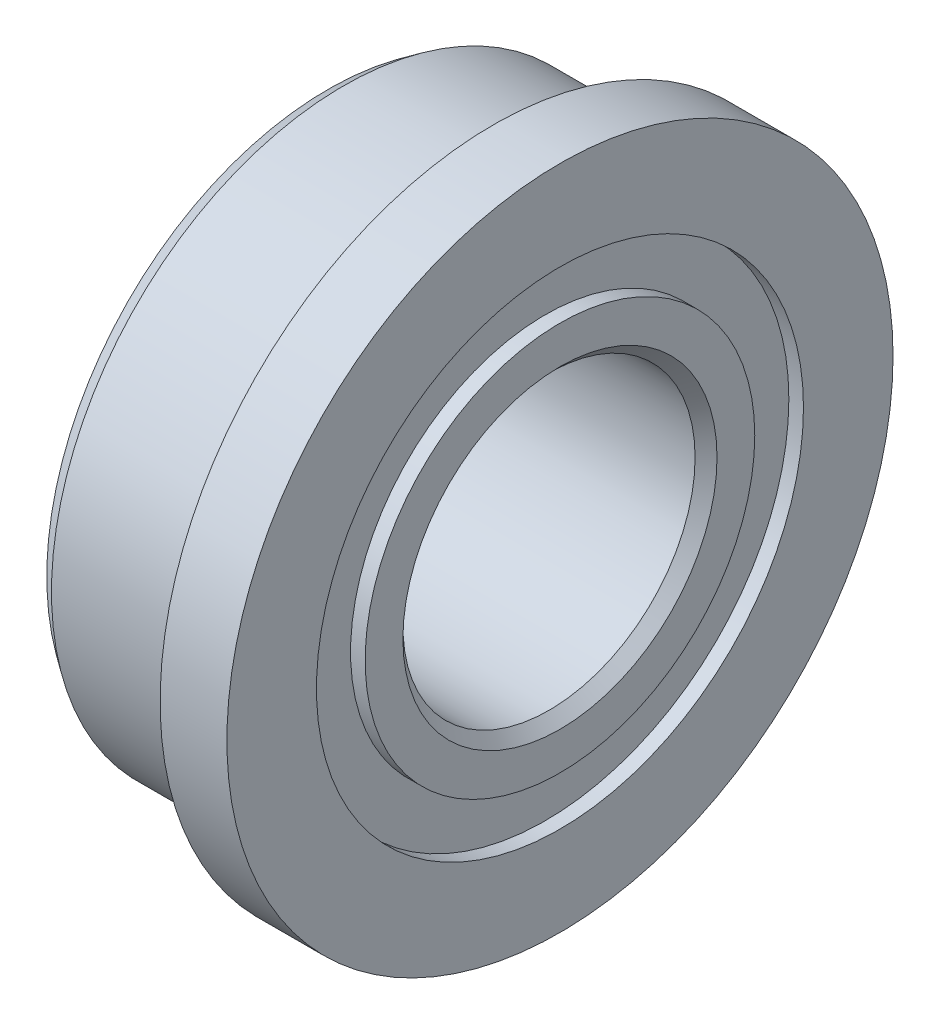
ISO-10303-21;
HEADER;
FILE_DESCRIPTION(('STEP AP214'),'2;1');
FILE_NAME('part.step','',(''),(''),'','','');
FILE_SCHEMA(('AUTOMOTIVE_DESIGN { 1 0 10303 214 1 1 1 1 }'));
ENDSEC;
DATA;
#1=APPLICATION_CONTEXT('core data for automotive mechanical design processes');
#2=APPLICATION_PROTOCOL_DEFINITION('international standard','automotive_design',2000,#1);
#3=PRODUCT_CONTEXT('',#1,'mechanical');
#4=PRODUCT('Part','Part','',(#3));
#5=PRODUCT_RELATED_PRODUCT_CATEGORY('part','',(#4));
#6=PRODUCT_DEFINITION_FORMATION('','',#4);
#7=PRODUCT_DEFINITION_CONTEXT('part definition',#1,'design');
#8=PRODUCT_DEFINITION('design','',#6,#7);
#9=PRODUCT_DEFINITION_SHAPE('','',#8);
#10=(LENGTH_UNIT() NAMED_UNIT(*) SI_UNIT(.MILLI.,.METRE.));
#11=(NAMED_UNIT(*) PLANE_ANGLE_UNIT() SI_UNIT($,.RADIAN.));
#12=(NAMED_UNIT(*) SI_UNIT($,.STERADIAN.) SOLID_ANGLE_UNIT());
#13=UNCERTAINTY_MEASURE_WITH_UNIT(LENGTH_MEASURE(1.E-05),#10,'distance_accuracy_value','');
#14=(GEOMETRIC_REPRESENTATION_CONTEXT(3) GLOBAL_UNCERTAINTY_ASSIGNED_CONTEXT((#13)) GLOBAL_UNIT_ASSIGNED_CONTEXT((#10,
#11,#12)) REPRESENTATION_CONTEXT('',''));
#15=CARTESIAN_POINT('',(0.,0.,0.));
#16=DIRECTION('',(0.,0.,1.));
#17=DIRECTION('',(1.,0.,0.));
#18=AXIS2_PLACEMENT_3D('',#15,#16,#17);
#19=CARTESIAN_POINT('',(-4.0000000000191,-1.89186773885686E-11,0.));
#20=DIRECTION('',(1.,0.,0.));
#21=DIRECTION('',(0.,0.,-1.));
#22=AXIS2_PLACEMENT_3D('',#19,#20,#21);
#23=CYLINDRICAL_SURFACE('',#22,3.33333333333333);
#24=CARTESIAN_POINT('',(-2.91107312729798,-1.89186773885686E-11,0.));
#25=DIRECTION('',(1.,0.,0.));
#26=DIRECTION('',(0.,0.,-1.));
#27=AXIS2_PLACEMENT_3D('',#24,#25,#26);
#28=CIRCLE('',#27,3.33333333333333);
#29=CARTESIAN_POINT('',(-2.91107312729798,-1.89186773885686E-11,-3.33333333333333));
#30=VERTEX_POINT('',#29);
#31=EDGE_CURVE('E96',#30,#30,#28,.T.);
#32=ORIENTED_EDGE('',*,*,#31,.T.);
#33=EDGE_LOOP('',(#32));
#34=FACE_BOUND('',#33,.T.);
#35=CARTESIAN_POINT('',(-3.17507312736301,-1.89186773885686E-11,0.));
#36=DIRECTION('',(1.,0.,0.));
#37=DIRECTION('',(0.,0.,-1.));
#38=AXIS2_PLACEMENT_3D('',#35,#36,#37);
#39=CIRCLE('',#38,3.33333333333333);
#40=CARTESIAN_POINT('',(-3.17507312736301,-1.89186773885686E-11,-3.33333333333333));
#41=VERTEX_POINT('',#40);
#42=EDGE_CURVE('E10',#41,#41,#39,.T.);
#43=ORIENTED_EDGE('',*,*,#42,.F.);
#44=EDGE_LOOP('',(#43));
#45=FACE_BOUND('',#44,.T.);
#46=ADVANCED_FACE('F37',(#34,#45),#23,.F.);
#47=CARTESIAN_POINT('',(-3.17507312736301,3.85010438242014,0.));
#48=DIRECTION('',(-1.,0.,0.));
#49=DIRECTION('',(0.,0.,1.));
#50=AXIS2_PLACEMENT_3D('',#47,#48,#49);
#51=PLANE('',#50);
#52=ORIENTED_EDGE('',*,*,#42,.T.);
#53=EDGE_LOOP('',(#52));
#54=FACE_BOUND('',#53,.T.);
#55=CARTESIAN_POINT('',(-3.17507312736301,-1.89186773885686E-11,0.));
#56=DIRECTION('',(1.,0.,0.));
#57=DIRECTION('',(0.,0.,-1.));
#58=AXIS2_PLACEMENT_3D('',#55,#56,#57);
#59=CIRCLE('',#58,3.85010438243906);
#60=CARTESIAN_POINT('',(-3.17507312736301,-1.89186773885686E-11,-3.85010438243906));
#61=VERTEX_POINT('',#60);
#62=EDGE_CURVE('E43',#61,#61,#59,.T.);
#63=ORIENTED_EDGE('',*,*,#62,.F.);
#64=EDGE_LOOP('',(#63));
#65=FACE_BOUND('',#64,.T.);
#66=ADVANCED_FACE('F114',(#54,#65),#51,.T.);
#67=CARTESIAN_POINT('',(-2.96099999992397,-1.89186773885686E-11,0.));
#68=DIRECTION('',(1.,0.,0.));
#69=DIRECTION('',(0.,0.,-1.));
#70=AXIS2_PLACEMENT_3D('',#67,#68,#69);
#71=CONICAL_SURFACE('',#70,4.,0.610865238198014);
#72=ORIENTED_EDGE('',*,*,#62,.T.);
#73=EDGE_LOOP('',(#72));
#74=FACE_BOUND('',#73,.T.);
#75=CARTESIAN_POINT('',(-2.96099999992397,-1.89186773885686E-11,0.));
#76=DIRECTION('',(1.,0.,0.));
#77=DIRECTION('',(0.,0.,-1.));
#78=AXIS2_PLACEMENT_3D('',#75,#76,#77);
#79=CIRCLE('',#78,4.);
#80=CARTESIAN_POINT('',(-2.96099999992397,-1.89186773885686E-11,-4.));
#81=VERTEX_POINT('',#80);
#82=EDGE_CURVE('E47',#81,#81,#79,.T.);
#83=ORIENTED_EDGE('',*,*,#82,.F.);
#84=EDGE_LOOP('',(#83));
#85=FACE_BOUND('',#84,.T.);
#86=ADVANCED_FACE('F118',(#74,#85),#71,.T.);
#87=CARTESIAN_POINT('',(-4.0000000000191,-1.89186773885686E-11,0.));
#88=DIRECTION('',(1.,0.,0.));
#89=DIRECTION('',(0.,0.,-1.));
#90=AXIS2_PLACEMENT_3D('',#87,#88,#89);
#91=CYLINDRICAL_SURFACE('',#90,4.);
#92=ORIENTED_EDGE('',*,*,#82,.T.);
#93=EDGE_LOOP('',(#92));
#94=FACE_BOUND('',#93,.T.);
#95=CARTESIAN_POINT('',(-0.934073127363007,-1.89186773885686E-11,0.));
#96=DIRECTION('',(1.,0.,0.));
#97=DIRECTION('',(0.,0.,-1.));
#98=AXIS2_PLACEMENT_3D('',#95,#96,#97);
#99=CIRCLE('',#98,4.);
#100=CARTESIAN_POINT('',(-0.934073127363007,-1.89186773885686E-11,-4.));
#101=VERTEX_POINT('',#100);
#102=EDGE_CURVE('E51',#101,#101,#99,.T.);
#103=ORIENTED_EDGE('',*,*,#102,.F.);
#104=EDGE_LOOP('',(#103));
#105=FACE_BOUND('',#104,.T.);
#106=ADVANCED_FACE('F122',(#94,#105),#91,.T.);
#107=CARTESIAN_POINT('',(-0.914073127363007,-1.89188942290031E-11,0.));
#108=DIRECTION('',(1.,0.,0.));
#109=DIRECTION('',(0.,0.,-1.));
#110=AXIS2_PLACEMENT_3D('',#107,#108,#109);
#111=TOROIDAL_SURFACE('',#110,4.,0.0200000000000001);
#112=ORIENTED_EDGE('',*,*,#102,.T.);
#113=EDGE_LOOP('',(#112));
#114=FACE_BOUND('',#113,.T.);
#115=CARTESIAN_POINT('',(-0.914073127363007,-1.89186773885686E-11,0.));
#116=DIRECTION('',(1.,0.,0.));
#117=DIRECTION('',(0.,0.,-1.));
#118=AXIS2_PLACEMENT_3D('',#115,#116,#117);
#119=CIRCLE('',#118,4.02);
#120=CARTESIAN_POINT('',(-0.914073127363007,-1.89186773885686E-11,-4.02));
#121=VERTEX_POINT('',#120);
#122=EDGE_CURVE('E56',#121,#121,#119,.T.);
#123=ORIENTED_EDGE('',*,*,#122,.F.);
#124=EDGE_LOOP('',(#123));
#125=FACE_BOUND('',#124,.T.);
#126=ADVANCED_FACE('F128',(#114,#125),#111,.F.);
#127=CARTESIAN_POINT('',(-0.914073127363007,4.55949999998108,0.));
#128=DIRECTION('',(-1.,0.,0.));
#129=DIRECTION('',(0.,0.,1.));
#130=AXIS2_PLACEMENT_3D('',#127,#128,#129);
#131=PLANE('',#130);
#132=ORIENTED_EDGE('',*,*,#122,.T.);
#133=EDGE_LOOP('',(#132));
#134=FACE_BOUND('',#133,.T.);
#135=CARTESIAN_POINT('',(-0.914073127363007,-1.89186773885686E-11,0.));
#136=DIRECTION('',(1.,0.,0.));
#137=DIRECTION('',(0.,0.,-1.));
#138=AXIS2_PLACEMENT_3D('',#135,#136,#137);
#139=CIRCLE('',#138,4.5595);
#140=CARTESIAN_POINT('',(-0.914073127363007,-1.89186773885686E-11,-4.5595));
#141=VERTEX_POINT('',#140);
#142=EDGE_CURVE('E59',#141,#141,#139,.T.);
#143=ORIENTED_EDGE('',*,*,#142,.F.);
#144=EDGE_LOOP('',(#143));
#145=FACE_BOUND('',#144,.T.);
#146=ADVANCED_FACE('F132',(#134,#145),#131,.T.);
#147=CARTESIAN_POINT('',(-4.0000000000191,-1.89186773885686E-11,0.));
#148=DIRECTION('',(1.,0.,0.));
#149=DIRECTION('',(0.,0.,-1.));
#150=AXIS2_PLACEMENT_3D('',#147,#148,#149);
#151=CYLINDRICAL_SURFACE('',#150,4.5595);
#152=ORIENTED_EDGE('',*,*,#142,.T.);
#153=EDGE_LOOP('',(#152));
#154=FACE_BOUND('',#153,.T.);
#155=CARTESIAN_POINT('',(-7.31273630070334E-05,-1.89186773885686E-11,0.));
#156=DIRECTION('',(1.,0.,0.));
#157=DIRECTION('',(0.,0.,-1.));
#158=AXIS2_PLACEMENT_3D('',#155,#156,#157);
#159=CIRCLE('',#158,4.5595);
#160=CARTESIAN_POINT('',(-7.31273630070334E-05,-1.89186773885686E-11,-4.5595));
#161=VERTEX_POINT('',#160);
#162=EDGE_CURVE('E62',#161,#161,#159,.T.);
#163=ORIENTED_EDGE('',*,*,#162,.F.);
#164=EDGE_LOOP('',(#163));
#165=FACE_BOUND('',#164,.T.);
#166=ADVANCED_FACE('F136',(#154,#165),#151,.T.);
#167=CARTESIAN_POINT('',(-7.31273630073948E-05,3.33333333331441,0.));
#168=DIRECTION('',(1.,0.,0.));
#169=DIRECTION('',(0.,0.,-1.));
#170=AXIS2_PLACEMENT_3D('',#167,#168,#169);
#171=PLANE('',#170);
#172=ORIENTED_EDGE('',*,*,#162,.T.);
#173=EDGE_LOOP('',(#172));
#174=FACE_BOUND('',#173,.T.);
#175=CARTESIAN_POINT('',(-7.31273630070334E-05,-1.89186773885686E-11,0.));
#176=DIRECTION('',(1.,0.,0.));
#177=DIRECTION('',(0.,0.,-1.));
#178=AXIS2_PLACEMENT_3D('',#175,#176,#177);
#179=CIRCLE('',#178,3.33333333333333);
#180=CARTESIAN_POINT('',(-7.31273630070334E-05,-1.89186773885686E-11,-3.33333333333333));
#181=VERTEX_POINT('',#180);
#182=EDGE_CURVE('E66',#181,#181,#179,.T.);
#183=ORIENTED_EDGE('',*,*,#182,.F.);
#184=EDGE_LOOP('',(#183));
#185=FACE_BOUND('',#184,.T.);
#186=ADVANCED_FACE('F140',(#174,#185),#171,.T.);
#187=CARTESIAN_POINT('',(-4.0000000000191,-1.89186773885686E-11,0.));
#188=DIRECTION('',(1.,0.,0.));
#189=DIRECTION('',(0.,0.,-1.));
#190=AXIS2_PLACEMENT_3D('',#187,#188,#189);
#191=CYLINDRICAL_SURFACE('',#190,3.33333333333333);
#192=ORIENTED_EDGE('',*,*,#182,.T.);
#193=EDGE_LOOP('',(#192));
#194=FACE_BOUND('',#193,.T.);
#195=CARTESIAN_POINT('',(-0.2,-1.89186773885686E-11,0.));
#196=DIRECTION('',(1.,0.,0.));
#197=DIRECTION('',(0.,0.,-1.));
#198=AXIS2_PLACEMENT_3D('',#195,#196,#197);
#199=CIRCLE('',#198,3.33333333333333);
#200=CARTESIAN_POINT('',(-0.2,-1.89186773885686E-11,-3.33333333333333));
#201=VERTEX_POINT('',#200);
#202=EDGE_CURVE('E69',#201,#201,#199,.T.);
#203=ORIENTED_EDGE('',*,*,#202,.F.);
#204=EDGE_LOOP('',(#203));
#205=FACE_BOUND('',#204,.T.);
#206=ADVANCED_FACE('F144',(#194,#205),#191,.F.);
#207=CARTESIAN_POINT('',(-0.2,2.66666666664775,0.));
#208=DIRECTION('',(1.,0.,0.));
#209=DIRECTION('',(0.,0.,-1.));
#210=AXIS2_PLACEMENT_3D('',#207,#208,#209);
#211=PLANE('',#210);
#212=ORIENTED_EDGE('',*,*,#202,.T.);
#213=EDGE_LOOP('',(#212));
#214=FACE_BOUND('',#213,.T.);
#215=CARTESIAN_POINT('',(-0.2,-1.89186773885686E-11,0.));
#216=DIRECTION('',(1.,0.,0.));
#217=DIRECTION('',(0.,0.,-1.));
#218=AXIS2_PLACEMENT_3D('',#215,#216,#217);
#219=CIRCLE('',#218,2.66666666666667);
#220=CARTESIAN_POINT('',(-0.2,-1.89186773885686E-11,-2.66666666666667));
#221=VERTEX_POINT('',#220);
#222=EDGE_CURVE('E72',#221,#221,#219,.T.);
#223=ORIENTED_EDGE('',*,*,#222,.F.);
#224=EDGE_LOOP('',(#223));
#225=FACE_BOUND('',#224,.T.);
#226=ADVANCED_FACE('F148',(#214,#225),#211,.T.);
#227=CARTESIAN_POINT('',(-4.0000000000191,-1.89186773885686E-11,0.));
#228=DIRECTION('',(1.,0.,0.));
#229=DIRECTION('',(0.,0.,-1.));
#230=AXIS2_PLACEMENT_3D('',#227,#228,#229);
#231=CYLINDRICAL_SURFACE('',#230,2.66666666666667);
#232=ORIENTED_EDGE('',*,*,#222,.T.);
#233=EDGE_LOOP('',(#232));
#234=FACE_BOUND('',#233,.T.);
#235=CARTESIAN_POINT('',(-7.31273630070334E-05,-1.89186773885686E-11,0.));
#236=DIRECTION('',(1.,0.,0.));
#237=DIRECTION('',(0.,0.,-1.));
#238=AXIS2_PLACEMENT_3D('',#235,#236,#237);
#239=CIRCLE('',#238,2.66666666666667);
#240=CARTESIAN_POINT('',(-7.31273630070334E-05,-1.89186773885686E-11,-2.66666666666667));
#241=VERTEX_POINT('',#240);
#242=EDGE_CURVE('E75',#241,#241,#239,.T.);
#243=ORIENTED_EDGE('',*,*,#242,.F.);
#244=EDGE_LOOP('',(#243));
#245=FACE_BOUND('',#244,.T.);
#246=ADVANCED_FACE('F152',(#234,#245),#231,.T.);
#247=CARTESIAN_POINT('',(-7.31273630073834E-05,2.15010438245956,0.));
#248=DIRECTION('',(1.,0.,0.));
#249=DIRECTION('',(0.,0.,-1.));
#250=AXIS2_PLACEMENT_3D('',#247,#248,#249);
#251=PLANE('',#250);
#252=ORIENTED_EDGE('',*,*,#242,.T.);
#253=EDGE_LOOP('',(#252));
#254=FACE_BOUND('',#253,.T.);
#255=CARTESIAN_POINT('',(-7.31273630070334E-05,-1.89186773885686E-11,0.));
#256=DIRECTION('',(1.,0.,0.));
#257=DIRECTION('',(0.,0.,-1.));
#258=AXIS2_PLACEMENT_3D('',#255,#256,#257);
#259=CIRCLE('',#258,2.15010438247848);
#260=CARTESIAN_POINT('',(-7.31273630070334E-05,-1.89186773885686E-11,-2.15010438247848));
#261=VERTEX_POINT('',#260);
#262=EDGE_CURVE('E78',#261,#261,#259,.T.);
#263=ORIENTED_EDGE('',*,*,#262,.F.);
#264=EDGE_LOOP('',(#263));
#265=FACE_BOUND('',#264,.T.);
#266=ADVANCED_FACE('F156',(#254,#265),#251,.T.);
#267=CARTESIAN_POINT('',(-0.149968672244967,-1.89186773885686E-11,0.));
#268=DIRECTION('',(1.,0.,0.));
#269=DIRECTION('',(0.,0.,-1.));
#270=AXIS2_PLACEMENT_3D('',#267,#268,#269);
#271=CONICAL_SURFACE('',#270,2.,0.786094288775304);
#272=ORIENTED_EDGE('',*,*,#262,.T.);
#273=EDGE_LOOP('',(#272));
#274=FACE_BOUND('',#273,.T.);
#275=CARTESIAN_POINT('',(-0.149968672244967,-1.89186773885686E-11,0.));
#276=DIRECTION('',(1.,0.,0.));
#277=DIRECTION('',(0.,0.,-1.));
#278=AXIS2_PLACEMENT_3D('',#275,#276,#277);
#279=CIRCLE('',#278,2.);
#280=CARTESIAN_POINT('',(-0.149968672244967,-1.89186773885686E-11,-2.));
#281=VERTEX_POINT('',#280);
#282=EDGE_CURVE('E81',#281,#281,#279,.T.);
#283=ORIENTED_EDGE('',*,*,#282,.F.);
#284=EDGE_LOOP('',(#283));
#285=FACE_BOUND('',#284,.T.);
#286=ADVANCED_FACE('F160',(#274,#285),#271,.F.);
#287=CARTESIAN_POINT('',(-4.0000000000191,-1.89186773885686E-11,0.));
#288=DIRECTION('',(1.,0.,0.));
#289=DIRECTION('',(0.,0.,-1.));
#290=AXIS2_PLACEMENT_3D('',#287,#288,#289);
#291=CYLINDRICAL_SURFACE('',#290,2.);
#292=ORIENTED_EDGE('',*,*,#282,.T.);
#293=EDGE_LOOP('',(#292));
#294=FACE_BOUND('',#293,.T.);
#295=CARTESIAN_POINT('',(-2.96114633056183,-1.89186773885686E-11,0.));
#296=DIRECTION('',(1.,0.,0.));
#297=DIRECTION('',(0.,0.,-1.));
#298=AXIS2_PLACEMENT_3D('',#295,#296,#297);
#299=CIRCLE('',#298,2.);
#300=CARTESIAN_POINT('',(-2.96114633056183,-1.89186773885686E-11,-2.));
#301=VERTEX_POINT('',#300);
#302=EDGE_CURVE('E84',#301,#301,#299,.T.);
#303=ORIENTED_EDGE('',*,*,#302,.F.);
#304=EDGE_LOOP('',(#303));
#305=FACE_BOUND('',#304,.T.);
#306=ADVANCED_FACE('F164',(#294,#305),#291,.F.);
#307=CARTESIAN_POINT('',(-3.17507312736301,-1.89186773885686E-11,0.));
#308=DIRECTION('',(-1.,0.,0.));
#309=DIRECTION('',(0.,0.,1.));
#310=AXIS2_PLACEMENT_3D('',#307,#308,#309);
#311=CONICAL_SURFACE('',#310,2.15010438247848,0.611840775427929);
#312=ORIENTED_EDGE('',*,*,#302,.T.);
#313=EDGE_LOOP('',(#312));
#314=FACE_BOUND('',#313,.T.);
#315=CARTESIAN_POINT('',(-3.17507312736301,-1.89186773885686E-11,0.));
#316=DIRECTION('',(1.,0.,0.));
#317=DIRECTION('',(0.,0.,-1.));
#318=AXIS2_PLACEMENT_3D('',#315,#316,#317);
#319=CIRCLE('',#318,2.15010438247848);
#320=CARTESIAN_POINT('',(-3.17507312736301,-1.89186773885686E-11,-2.15010438247848));
#321=VERTEX_POINT('',#320);
#322=EDGE_CURVE('E87',#321,#321,#319,.T.);
#323=ORIENTED_EDGE('',*,*,#322,.F.);
#324=EDGE_LOOP('',(#323));
#325=FACE_BOUND('',#324,.T.);
#326=ADVANCED_FACE('F168',(#314,#325),#311,.F.);
#327=CARTESIAN_POINT('',(-3.17507312736301,2.66666666664775,0.));
#328=DIRECTION('',(-1.,0.,0.));
#329=DIRECTION('',(0.,0.,1.));
#330=AXIS2_PLACEMENT_3D('',#327,#328,#329);
#331=PLANE('',#330);
#332=ORIENTED_EDGE('',*,*,#322,.T.);
#333=EDGE_LOOP('',(#332));
#334=FACE_BOUND('',#333,.T.);
#335=CARTESIAN_POINT('',(-3.17507312736301,-1.89186773885686E-11,0.));
#336=DIRECTION('',(1.,0.,0.));
#337=DIRECTION('',(0.,0.,-1.));
#338=AXIS2_PLACEMENT_3D('',#335,#336,#337);
#339=CIRCLE('',#338,2.66666666666667);
#340=CARTESIAN_POINT('',(-3.17507312736301,-1.89186773885686E-11,-2.66666666666667));
#341=VERTEX_POINT('',#340);
#342=EDGE_CURVE('E90',#341,#341,#339,.T.);
#343=ORIENTED_EDGE('',*,*,#342,.F.);
#344=EDGE_LOOP('',(#343));
#345=FACE_BOUND('',#344,.T.);
#346=ADVANCED_FACE('F110',(#334,#345),#331,.T.);
#347=CARTESIAN_POINT('',(-4.0000000000191,-1.89186773885686E-11,0.));
#348=DIRECTION('',(1.,0.,0.));
#349=DIRECTION('',(0.,0.,-1.));
#350=AXIS2_PLACEMENT_3D('',#347,#348,#349);
#351=CYLINDRICAL_SURFACE('',#350,2.66666666666667);
#352=ORIENTED_EDGE('',*,*,#342,.T.);
#353=EDGE_LOOP('',(#352));
#354=FACE_BOUND('',#353,.T.);
#355=CARTESIAN_POINT('',(-2.91107312729798,-1.89186773885686E-11,0.));
#356=DIRECTION('',(1.,0.,0.));
#357=DIRECTION('',(0.,0.,-1.));
#358=AXIS2_PLACEMENT_3D('',#355,#356,#357);
#359=CIRCLE('',#358,2.66666666666667);
#360=CARTESIAN_POINT('',(-2.91107312729798,-1.89186773885686E-11,-2.66666666666667));
#361=VERTEX_POINT('',#360);
#362=EDGE_CURVE('E93',#361,#361,#359,.T.);
#363=ORIENTED_EDGE('',*,*,#362,.F.);
#364=EDGE_LOOP('',(#363));
#365=FACE_BOUND('',#364,.T.);
#366=ADVANCED_FACE('F104',(#354,#365),#351,.T.);
#367=CARTESIAN_POINT('',(-2.91107312729798,3.33333333331441,0.));
#368=DIRECTION('',(-1.,0.,0.));
#369=DIRECTION('',(0.,0.,1.));
#370=AXIS2_PLACEMENT_3D('',#367,#368,#369);
#371=PLANE('',#370);
#372=ORIENTED_EDGE('',*,*,#362,.T.);
#373=EDGE_LOOP('',(#372));
#374=FACE_BOUND('',#373,.T.);
#375=ORIENTED_EDGE('',*,*,#31,.F.);
#376=EDGE_LOOP('',(#375));
#377=FACE_BOUND('',#376,.T.);
#378=ADVANCED_FACE('F102',(#374,#377),#371,.T.);
#379=CLOSED_SHELL('',(#46,#66,#86,#106,#126,#146,#166,#186,#206,#226,#246,#266,#286,#306,#326,
#346,#366,#378));
#380=MANIFOLD_SOLID_BREP('B2',#379);
#381=ADVANCED_BREP_SHAPE_REPRESENTATION('',(#18,#380),#14);
#382=SHAPE_DEFINITION_REPRESENTATION(#9,#381);
ENDSEC;
END-ISO-10303-21;
